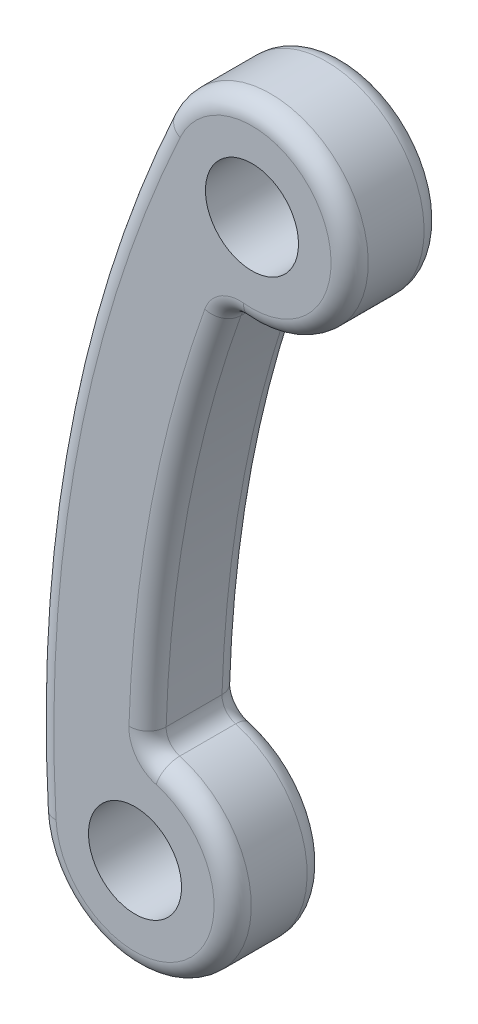
ISO-10303-21;
HEADER;
FILE_DESCRIPTION(('STEP AP214'),'2;1');
FILE_NAME('part.step','',(''),(''),'','','');
FILE_SCHEMA(('AUTOMOTIVE_DESIGN { 1 0 10303 214 1 1 1 1 }'));
ENDSEC;
DATA;
#1=APPLICATION_CONTEXT('core data for automotive mechanical design processes');
#2=APPLICATION_PROTOCOL_DEFINITION('international standard','automotive_design',2000,#1);
#3=PRODUCT_CONTEXT('',#1,'mechanical');
#4=PRODUCT('Part','Part','',(#3));
#5=PRODUCT_RELATED_PRODUCT_CATEGORY('part','',(#4));
#6=PRODUCT_DEFINITION_FORMATION('','',#4);
#7=PRODUCT_DEFINITION_CONTEXT('part definition',#1,'design');
#8=PRODUCT_DEFINITION('design','',#6,#7);
#9=PRODUCT_DEFINITION_SHAPE('','',#8);
#10=(LENGTH_UNIT() NAMED_UNIT(*) SI_UNIT(.MILLI.,.METRE.));
#11=(NAMED_UNIT(*) PLANE_ANGLE_UNIT() SI_UNIT($,.RADIAN.));
#12=(NAMED_UNIT(*) SI_UNIT($,.STERADIAN.) SOLID_ANGLE_UNIT());
#13=UNCERTAINTY_MEASURE_WITH_UNIT(LENGTH_MEASURE(1.E-05),#10,'distance_accuracy_value','');
#14=(GEOMETRIC_REPRESENTATION_CONTEXT(3) GLOBAL_UNCERTAINTY_ASSIGNED_CONTEXT((#13)) GLOBAL_UNIT_ASSIGNED_CONTEXT((#10,
#11,#12)) REPRESENTATION_CONTEXT('',''));
#15=CARTESIAN_POINT('',(0.,0.,0.));
#16=DIRECTION('',(0.,0.,1.));
#17=DIRECTION('',(1.,0.,0.));
#18=AXIS2_PLACEMENT_3D('',#15,#16,#17);
#19=CARTESIAN_POINT('',(-69.6406788681633,-3.90363251105414,10.));
#20=DIRECTION('',(0.,0.,1.));
#21=DIRECTION('',(1.,0.,0.));
#22=AXIS2_PLACEMENT_3D('',#19,#20,#21);
#23=PLANE('',#22);
#24=CARTESIAN_POINT('',(-128.014112855284,45.9171744543879,10.));
#25=DIRECTION('',(0.,0.,1.));
#26=DIRECTION('',(1.,0.,0.));
#27=AXIS2_PLACEMENT_3D('',#24,#25,#26);
#28=CIRCLE('',#27,4.);
#29=CARTESIAN_POINT('',(-127.597067497737,49.8953741941883,10.));
#30=VERTEX_POINT('',#29);
#31=CARTESIAN_POINT('',(-131.779233821616,47.2676795853993,10.));
#32=VERTEX_POINT('',#31);
#33=EDGE_CURVE('E121',#30,#32,#28,.T.);
#34=ORIENTED_EDGE('',*,*,#33,.F.);
#35=CARTESIAN_POINT('',(-126.710846112949,58.3490486412642,10.));
#36=DIRECTION('',(0.,0.,1.));
#37=DIRECTION('',(1.,0.,0.));
#38=AXIS2_PLACEMENT_3D('',#35,#36,#37);
#39=CIRCLE('',#38,8.49999999999992);
#40=CARTESIAN_POINT('',(-134.431578671802,61.9043670172552,10.));
#41=VERTEX_POINT('',#40);
#42=EDGE_CURVE('E125',#30,#41,#39,.T.);
#43=ORIENTED_EDGE('',*,*,#42,.T.);
#44=CARTESIAN_POINT('',(0.,0.,10.));
#45=DIRECTION('',(0.,0.,1.));
#46=DIRECTION('',(1.,0.,0.));
#47=AXIS2_PLACEMENT_3D('',#44,#45,#46);
#48=CIRCLE('',#47,148.);
#49=CARTESIAN_POINT('',(-147.768035447859,-8.28297651091058,10.));
#50=VERTEX_POINT('',#49);
#51=EDGE_CURVE('E148',#41,#50,#48,.T.);
#52=ORIENTED_EDGE('',*,*,#51,.T.);
#53=CARTESIAN_POINT('',(-139.281357736327,-7.80726502210829,10.));
#54=DIRECTION('',(0.,0.,1.));
#55=DIRECTION('',(1.,0.,0.));
#56=AXIS2_PLACEMENT_3D('',#53,#54,#55);
#57=CIRCLE('',#56,8.50000000000001);
#58=CARTESIAN_POINT('',(-137.005159936122,0.382296844948076,10.));
#59=VERTEX_POINT('',#58);
#60=EDGE_CURVE('E152',#50,#59,#57,.T.);
#61=ORIENTED_EDGE('',*,*,#60,.T.);
#62=CARTESIAN_POINT('',(-135.934008030143,4.23620831179809,10.));
#63=DIRECTION('',(0.,0.,1.));
#64=DIRECTION('',(1.,0.,0.));
#65=AXIS2_PLACEMENT_3D('',#62,#63,#64);
#66=CIRCLE('',#65,4.);
#67=CARTESIAN_POINT('',(-139.932067089853,4.3608026739098,10.));
#68=VERTEX_POINT('',#67);
#69=EDGE_CURVE('E251',#68,#59,#66,.T.);
#70=ORIENTED_EDGE('',*,*,#69,.F.);
#71=CARTESIAN_POINT('',(0.,0.,10.));
#72=DIRECTION('',(0.,0.,1.));
#73=DIRECTION('',(1.,0.,0.));
#74=AXIS2_PLACEMENT_3D('',#71,#72,#73);
#75=CIRCLE('',#74,140.);
#76=EDGE_CURVE('E127',#68,#32,#75,.F.);
#77=ORIENTED_EDGE('',*,*,#76,.T.);
#78=EDGE_LOOP('',(#34,#43,#52,#61,#70,#77));
#79=FACE_BOUND('',#78,.T.);
#80=CARTESIAN_POINT('',(-126.710846112949,58.3490486412642,10.));
#81=DIRECTION('',(0.,0.,1.));
#82=DIRECTION('',(1.,0.,0.));
#83=AXIS2_PLACEMENT_3D('',#80,#81,#82);
#84=CIRCLE('',#83,5.00000000000001);
#85=CARTESIAN_POINT('',(-121.710846112949,58.3490486412642,10.));
#86=VERTEX_POINT('',#85);
#87=EDGE_CURVE('E240',#86,#86,#84,.T.);
#88=ORIENTED_EDGE('',*,*,#87,.F.);
#89=EDGE_LOOP('',(#88));
#90=FACE_BOUND('',#89,.T.);
#91=CARTESIAN_POINT('',(-139.281357736327,-7.80726502210829,10.));
#92=DIRECTION('',(0.,0.,1.));
#93=DIRECTION('',(1.,0.,0.));
#94=AXIS2_PLACEMENT_3D('',#91,#92,#93);
#95=CIRCLE('',#94,4.99999999999999);
#96=CARTESIAN_POINT('',(-134.281357736327,-7.80726502210829,10.));
#97=VERTEX_POINT('',#96);
#98=EDGE_CURVE('E232',#97,#97,#95,.T.);
#99=ORIENTED_EDGE('',*,*,#98,.F.);
#100=EDGE_LOOP('',(#99));
#101=FACE_BOUND('',#100,.T.);
#102=ADVANCED_FACE('F33',(#79,#90,#101),#23,.T.);
#103=CARTESIAN_POINT('',(-69.6406788681633,-3.90363251105414,0.));
#104=DIRECTION('',(0.,0.,1.));
#105=DIRECTION('',(1.,0.,0.));
#106=AXIS2_PLACEMENT_3D('',#103,#104,#105);
#107=PLANE('',#106);
#108=CARTESIAN_POINT('',(0.,0.,0.));
#109=DIRECTION('',(0.,0.,1.));
#110=DIRECTION('',(1.,0.,0.));
#111=AXIS2_PLACEMENT_3D('',#108,#109,#110);
#112=CIRCLE('',#111,148.);
#113=CARTESIAN_POINT('',(-147.768035447859,-8.28297651091058,0.));
#114=VERTEX_POINT('',#113);
#115=CARTESIAN_POINT('',(-134.431578671802,61.9043670172552,0.));
#116=VERTEX_POINT('',#115);
#117=EDGE_CURVE('E171',#114,#116,#112,.F.);
#118=ORIENTED_EDGE('',*,*,#117,.T.);
#119=CARTESIAN_POINT('',(-126.710846112949,58.3490486412642,0.));
#120=DIRECTION('',(0.,0.,1.));
#121=DIRECTION('',(1.,0.,0.));
#122=AXIS2_PLACEMENT_3D('',#119,#120,#121);
#123=CIRCLE('',#122,8.49999999999992);
#124=CARTESIAN_POINT('',(-127.597067497737,49.8953741941883,0.));
#125=VERTEX_POINT('',#124);
#126=EDGE_CURVE('E175',#116,#125,#123,.F.);
#127=ORIENTED_EDGE('',*,*,#126,.T.);
#128=CARTESIAN_POINT('',(-128.014112855284,45.9171744543879,0.));
#129=DIRECTION('',(0.,0.,1.));
#130=DIRECTION('',(1.,0.,0.));
#131=AXIS2_PLACEMENT_3D('',#128,#129,#130);
#132=CIRCLE('',#131,4.);
#133=CARTESIAN_POINT('',(-131.779233821616,47.2676795853993,0.));
#134=VERTEX_POINT('',#133);
#135=EDGE_CURVE('E173',#134,#125,#132,.F.);
#136=ORIENTED_EDGE('',*,*,#135,.F.);
#137=CARTESIAN_POINT('',(0.,0.,0.));
#138=DIRECTION('',(0.,0.,1.));
#139=DIRECTION('',(1.,0.,0.));
#140=AXIS2_PLACEMENT_3D('',#137,#138,#139);
#141=CIRCLE('',#140,140.);
#142=CARTESIAN_POINT('',(-139.932067089853,4.3608026739098,0.));
#143=VERTEX_POINT('',#142);
#144=EDGE_CURVE('E167',#134,#143,#141,.T.);
#145=ORIENTED_EDGE('',*,*,#144,.T.);
#146=CARTESIAN_POINT('',(-135.934008030143,4.23620831179809,0.));
#147=DIRECTION('',(0.,0.,1.));
#148=DIRECTION('',(1.,0.,0.));
#149=AXIS2_PLACEMENT_3D('',#146,#147,#148);
#150=CIRCLE('',#149,4.);
#151=CARTESIAN_POINT('',(-137.005159936122,0.382296844948076,0.));
#152=VERTEX_POINT('',#151);
#153=EDGE_CURVE('E164',#152,#143,#150,.F.);
#154=ORIENTED_EDGE('',*,*,#153,.F.);
#155=CARTESIAN_POINT('',(-139.281357736327,-7.80726502210829,0.));
#156=DIRECTION('',(0.,0.,1.));
#157=DIRECTION('',(1.,0.,0.));
#158=AXIS2_PLACEMENT_3D('',#155,#156,#157);
#159=CIRCLE('',#158,8.50000000000001);
#160=EDGE_CURVE('E169',#152,#114,#159,.F.);
#161=ORIENTED_EDGE('',*,*,#160,.T.);
#162=EDGE_LOOP('',(#118,#127,#136,#145,#154,#161));
#163=FACE_BOUND('',#162,.T.);
#164=CARTESIAN_POINT('',(-126.710846112949,58.3490486412642,0.));
#165=DIRECTION('',(0.,0.,1.));
#166=DIRECTION('',(1.,0.,0.));
#167=AXIS2_PLACEMENT_3D('',#164,#165,#166);
#168=CIRCLE('',#167,5.00000000000001);
#169=CARTESIAN_POINT('',(-121.710846112949,58.3490486412642,0.));
#170=VERTEX_POINT('',#169);
#171=EDGE_CURVE('E237',#170,#170,#168,.T.);
#172=ORIENTED_EDGE('',*,*,#171,.T.);
#173=EDGE_LOOP('',(#172));
#174=FACE_BOUND('',#173,.T.);
#175=CARTESIAN_POINT('',(-139.281357736327,-7.80726502210829,0.));
#176=DIRECTION('',(0.,0.,1.));
#177=DIRECTION('',(1.,0.,0.));
#178=AXIS2_PLACEMENT_3D('',#175,#176,#177);
#179=CIRCLE('',#178,4.99999999999999);
#180=CARTESIAN_POINT('',(-134.281357736327,-7.80726502210829,0.));
#181=VERTEX_POINT('',#180);
#182=EDGE_CURVE('E226',#181,#181,#179,.T.);
#183=ORIENTED_EDGE('',*,*,#182,.T.);
#184=EDGE_LOOP('',(#183));
#185=FACE_BOUND('',#184,.T.);
#186=ADVANCED_FACE('F280',(#163,#174,#185),#107,.F.);
#187=CARTESIAN_POINT('',(0.,0.,10.));
#188=DIRECTION('',(0.,0.,-1.));
#189=DIRECTION('',(-1.,0.,0.));
#190=AXIS2_PLACEMENT_3D('',#187,#188,#189);
#191=CYLINDRICAL_SURFACE('',#190,138.);
#192=CARTESIAN_POINT('',(0.,0.,8.));
#193=DIRECTION('',(0.,0.,1.));
#194=DIRECTION('',(1.,0.,0.));
#195=AXIS2_PLACEMENT_3D('',#192,#193,#194);
#196=CIRCLE('',#195,138.);
#197=CARTESIAN_POINT('',(-129.89667333845,46.5924270198936,8.));
#198=VERTEX_POINT('',#197);
#199=CARTESIAN_POINT('',(-137.933037559998,4.29850549285394,8.));
#200=VERTEX_POINT('',#199);
#201=EDGE_CURVE('E42',#198,#200,#196,.T.);
#202=ORIENTED_EDGE('',*,*,#201,.T.);
#203=DIRECTION('',(0.,0.,-1.));
#204=VECTOR('',#203,1.);
#205=CARTESIAN_POINT('',(-137.933037559998,4.29850549285394,10.));
#206=LINE('',#205,#204);
#207=CARTESIAN_POINT('',(-137.933037559998,4.29850549285394,2.));
#208=VERTEX_POINT('',#207);
#209=EDGE_CURVE('E11',#200,#208,#206,.T.);
#210=ORIENTED_EDGE('',*,*,#209,.T.);
#211=CARTESIAN_POINT('',(0.,0.,2.));
#212=DIRECTION('',(0.,0.,1.));
#213=DIRECTION('',(1.,0.,0.));
#214=AXIS2_PLACEMENT_3D('',#211,#212,#213);
#215=CIRCLE('',#214,138.);
#216=CARTESIAN_POINT('',(-129.89667333845,46.5924270198936,2.));
#217=VERTEX_POINT('',#216);
#218=EDGE_CURVE('E184',#208,#217,#215,.F.);
#219=ORIENTED_EDGE('',*,*,#218,.T.);
#220=DIRECTION('',(0.,0.,-1.));
#221=VECTOR('',#220,1.);
#222=CARTESIAN_POINT('',(-129.89667333845,46.5924270198936,10.));
#223=LINE('',#222,#221);
#224=EDGE_CURVE('E53',#217,#198,#223,.F.);
#225=ORIENTED_EDGE('',*,*,#224,.T.);
#226=EDGE_LOOP('',(#202,#210,#219,#225));
#227=FACE_BOUND('',#226,.T.);
#228=ADVANCED_FACE('F311',(#227),#191,.F.);
#229=CARTESIAN_POINT('',(-126.710846112949,58.3490486412642,10.));
#230=DIRECTION('',(0.,0.,-1.));
#231=DIRECTION('',(-1.,0.,0.));
#232=AXIS2_PLACEMENT_3D('',#229,#230,#231);
#233=CYLINDRICAL_SURFACE('',#232,10.4999999999999);
#234=DIRECTION('',(0.,0.,-1.));
#235=VECTOR('',#234,1.);
#236=CARTESIAN_POINT('',(-136.248221626827,62.7409125174884,10.));
#237=LINE('',#236,#235);
#238=CARTESIAN_POINT('',(-136.248221626827,62.7409125174884,8.));
#239=VERTEX_POINT('',#238);
#240=CARTESIAN_POINT('',(-136.248221626827,62.7409125174884,2.));
#241=VERTEX_POINT('',#240);
#242=EDGE_CURVE('E131',#239,#241,#237,.T.);
#243=ORIENTED_EDGE('',*,*,#242,.F.);
#244=CARTESIAN_POINT('',(-126.710846112949,58.3490486412642,8.));
#245=DIRECTION('',(0.,0.,1.));
#246=DIRECTION('',(1.,0.,0.));
#247=AXIS2_PLACEMENT_3D('',#244,#245,#246);
#248=CIRCLE('',#247,10.4999999999999);
#249=CARTESIAN_POINT('',(-127.80559017651,47.9062743242881,8.));
#250=VERTEX_POINT('',#249);
#251=EDGE_CURVE('E157',#239,#250,#248,.F.);
#252=ORIENTED_EDGE('',*,*,#251,.T.);
#253=DIRECTION('',(0.,0.,-1.));
#254=VECTOR('',#253,1.);
#255=CARTESIAN_POINT('',(-127.80559017651,47.9062743242881,10.));
#256=LINE('',#255,#254);
#257=CARTESIAN_POINT('',(-127.80559017651,47.9062743242881,2.));
#258=VERTEX_POINT('',#257);
#259=EDGE_CURVE('E147',#250,#258,#256,.T.);
#260=ORIENTED_EDGE('',*,*,#259,.T.);
#261=CARTESIAN_POINT('',(-126.710846112949,58.3490486412642,2.));
#262=DIRECTION('',(0.,0.,1.));
#263=DIRECTION('',(1.,0.,0.));
#264=AXIS2_PLACEMENT_3D('',#261,#262,#263);
#265=CIRCLE('',#264,10.4999999999999);
#266=EDGE_CURVE('E150',#258,#241,#265,.T.);
#267=ORIENTED_EDGE('',*,*,#266,.T.);
#268=EDGE_LOOP('',(#243,#252,#260,#267));
#269=FACE_BOUND('',#268,.T.);
#270=ADVANCED_FACE('F295',(#269),#233,.T.);
#271=CARTESIAN_POINT('',(0.,0.,10.));
#272=DIRECTION('',(0.,0.,-1.));
#273=DIRECTION('',(-1.,0.,0.));
#274=AXIS2_PLACEMENT_3D('',#271,#272,#273);
#275=CYLINDRICAL_SURFACE('',#274,150.);
#276=DIRECTION('',(0.,0.,-1.));
#277=VECTOR('',#276,1.);
#278=CARTESIAN_POINT('',(-149.764900791749,-8.39490862592289,10.));
#279=LINE('',#278,#277);
#280=CARTESIAN_POINT('',(-149.764900791749,-8.39490862592289,8.));
#281=VERTEX_POINT('',#280);
#282=CARTESIAN_POINT('',(-149.764900791749,-8.39490862592289,2.));
#283=VERTEX_POINT('',#282);
#284=EDGE_CURVE('E243',#281,#283,#279,.T.);
#285=ORIENTED_EDGE('',*,*,#284,.F.);
#286=CARTESIAN_POINT('',(0.,0.,8.));
#287=DIRECTION('',(0.,0.,1.));
#288=DIRECTION('',(1.,0.,0.));
#289=AXIS2_PLACEMENT_3D('',#286,#287,#288);
#290=CIRCLE('',#289,150.);
#291=EDGE_CURVE('E162',#281,#239,#290,.F.);
#292=ORIENTED_EDGE('',*,*,#291,.T.);
#293=ORIENTED_EDGE('',*,*,#242,.T.);
#294=CARTESIAN_POINT('',(0.,0.,2.));
#295=DIRECTION('',(0.,0.,1.));
#296=DIRECTION('',(1.,0.,0.));
#297=AXIS2_PLACEMENT_3D('',#294,#295,#296);
#298=CIRCLE('',#297,150.);
#299=EDGE_CURVE('E160',#241,#283,#298,.T.);
#300=ORIENTED_EDGE('',*,*,#299,.T.);
#301=EDGE_LOOP('',(#285,#292,#293,#300));
#302=FACE_BOUND('',#301,.T.);
#303=ADVANCED_FACE('F270',(#302),#275,.T.);
#304=CARTESIAN_POINT('',(-139.281357736327,-7.80726502210829,10.));
#305=DIRECTION('',(0.,0.,-1.));
#306=DIRECTION('',(-1.,0.,0.));
#307=AXIS2_PLACEMENT_3D('',#304,#305,#306);
#308=CYLINDRICAL_SURFACE('',#307,10.5);
#309=DIRECTION('',(0.,0.,-1.));
#310=VECTOR('',#309,1.);
#311=CARTESIAN_POINT('',(-136.469583983133,2.3092525783731,10.));
#312=LINE('',#311,#310);
#313=CARTESIAN_POINT('',(-136.469583983133,2.3092525783731,2.));
#314=VERTEX_POINT('',#313);
#315=CARTESIAN_POINT('',(-136.469583983133,2.3092525783731,8.));
#316=VERTEX_POINT('',#315);
#317=EDGE_CURVE('E178',#314,#316,#312,.F.);
#318=ORIENTED_EDGE('',*,*,#317,.T.);
#319=CARTESIAN_POINT('',(-139.281357736327,-7.80726502210829,8.));
#320=DIRECTION('',(0.,0.,1.));
#321=DIRECTION('',(1.,0.,0.));
#322=AXIS2_PLACEMENT_3D('',#319,#320,#321);
#323=CIRCLE('',#322,10.5);
#324=EDGE_CURVE('E182',#316,#281,#323,.F.);
#325=ORIENTED_EDGE('',*,*,#324,.T.);
#326=ORIENTED_EDGE('',*,*,#284,.T.);
#327=CARTESIAN_POINT('',(-139.281357736327,-7.80726502210829,2.));
#328=DIRECTION('',(0.,0.,1.));
#329=DIRECTION('',(1.,0.,0.));
#330=AXIS2_PLACEMENT_3D('',#327,#328,#329);
#331=CIRCLE('',#330,10.5);
#332=EDGE_CURVE('E180',#283,#314,#331,.T.);
#333=ORIENTED_EDGE('',*,*,#332,.T.);
#334=EDGE_LOOP('',(#318,#325,#326,#333));
#335=FACE_BOUND('',#334,.T.);
#336=ADVANCED_FACE('F265',(#335),#308,.T.);
#337=CARTESIAN_POINT('',(-126.710846112949,58.3490486412642,10.));
#338=DIRECTION('',(0.,0.,-1.));
#339=DIRECTION('',(-1.,0.,0.));
#340=AXIS2_PLACEMENT_3D('',#337,#338,#339);
#341=CYLINDRICAL_SURFACE('',#340,5.00000000000001);
#342=ORIENTED_EDGE('',*,*,#87,.T.);
#343=EDGE_LOOP('',(#342));
#344=FACE_BOUND('',#343,.T.);
#345=ORIENTED_EDGE('',*,*,#171,.F.);
#346=EDGE_LOOP('',(#345));
#347=FACE_BOUND('',#346,.T.);
#348=ADVANCED_FACE('F314',(#344,#347),#341,.F.);
#349=CARTESIAN_POINT('',(-139.281357736327,-7.80726502210829,10.));
#350=DIRECTION('',(0.,0.,-1.));
#351=DIRECTION('',(-1.,0.,0.));
#352=AXIS2_PLACEMENT_3D('',#349,#350,#351);
#353=CYLINDRICAL_SURFACE('',#352,4.99999999999999);
#354=ORIENTED_EDGE('',*,*,#98,.T.);
#355=EDGE_LOOP('',(#354));
#356=FACE_BOUND('',#355,.T.);
#357=ORIENTED_EDGE('',*,*,#182,.F.);
#358=EDGE_LOOP('',(#357));
#359=FACE_BOUND('',#358,.T.);
#360=ADVANCED_FACE('F347',(#356,#359),#353,.F.);
#361=CARTESIAN_POINT('',(-139.281357736327,-7.80726502210829,2.));
#362=DIRECTION('',(0.,0.,1.));
#363=DIRECTION('',(1.,0.,0.));
#364=AXIS2_PLACEMENT_3D('',#361,#362,#363);
#365=TOROIDAL_SURFACE('',#364,8.50000000000001,2.);
#366=CARTESIAN_POINT('',(-137.005159936122,0.382296844948075,2.));
#367=DIRECTION('',(-0.963477866712511,0.267787976494668,0.));
#368=DIRECTION('',(-0.267787976494668,-0.963477866712511,0.));
#369=AXIS2_PLACEMENT_3D('',#366,#367,#368);
#370=CIRCLE('',#369,2.);
#371=EDGE_CURVE('E220',#314,#152,#370,.T.);
#372=ORIENTED_EDGE('',*,*,#371,.F.);
#373=ORIENTED_EDGE('',*,*,#332,.F.);
#374=CARTESIAN_POINT('',(-147.768035447859,-8.28297651091058,2.));
#375=DIRECTION('',(-0.0559660575061528,0.998432671944993,0.));
#376=DIRECTION('',(-0.998432671944993,-0.0559660575061528,0.));
#377=AXIS2_PLACEMENT_3D('',#374,#375,#376);
#378=CIRCLE('',#377,2.);
#379=EDGE_CURVE('E37',#114,#283,#378,.T.);
#380=ORIENTED_EDGE('',*,*,#379,.F.);
#381=ORIENTED_EDGE('',*,*,#160,.F.);
#382=EDGE_LOOP('',(#372,#373,#380,#381));
#383=FACE_BOUND('',#382,.T.);
#384=ADVANCED_FACE('F35',(#383),#365,.T.);
#385=CARTESIAN_POINT('',(0.,0.,2.));
#386=DIRECTION('',(0.,0.,1.));
#387=DIRECTION('',(1.,0.,0.));
#388=AXIS2_PLACEMENT_3D('',#385,#386,#387);
#389=TOROIDAL_SURFACE('',#388,148.,2.);
#390=ORIENTED_EDGE('',*,*,#379,.T.);
#391=ORIENTED_EDGE('',*,*,#299,.F.);
#392=CARTESIAN_POINT('',(-134.431578671802,61.9043670172552,2.));
#393=DIRECTION('',(0.418272750116593,0.908321477512176,0.));
#394=DIRECTION('',(-0.908321477512176,0.418272750116593,0.));
#395=AXIS2_PLACEMENT_3D('',#392,#393,#394);
#396=CIRCLE('',#395,2.);
#397=EDGE_CURVE('E218',#116,#241,#396,.T.);
#398=ORIENTED_EDGE('',*,*,#397,.F.);
#399=ORIENTED_EDGE('',*,*,#117,.F.);
#400=EDGE_LOOP('',(#390,#391,#398,#399));
#401=FACE_BOUND('',#400,.T.);
#402=ADVANCED_FACE('F273',(#401),#389,.T.);
#403=CARTESIAN_POINT('',(-135.934008030143,4.23620831179809,2.));
#404=DIRECTION('',(0.,0.,1.));
#405=DIRECTION('',(1.,0.,0.));
#406=AXIS2_PLACEMENT_3D('',#403,#404,#405);
#407=TOROIDAL_SURFACE('',#406,4.,2.);
#408=ORIENTED_EDGE('',*,*,#371,.T.);
#409=ORIENTED_EDGE('',*,*,#153,.T.);
#410=CARTESIAN_POINT('',(-139.932067089853,4.3608026739098,2.));
#411=DIRECTION('',(-0.0311485905279271,-0.999514764927524,0.));
#412=DIRECTION('',(0.999514764927524,-0.0311485905279271,0.));
#413=AXIS2_PLACEMENT_3D('',#410,#411,#412);
#414=CIRCLE('',#413,2.);
#415=EDGE_CURVE('E215',#208,#143,#414,.F.);
#416=ORIENTED_EDGE('',*,*,#415,.F.);
#417=CARTESIAN_POINT('',(-135.934008030143,4.23620831179809,2.));
#418=DIRECTION('',(0.,0.,1.));
#419=DIRECTION('',(1.,0.,0.));
#420=AXIS2_PLACEMENT_3D('',#417,#418,#419);
#421=CIRCLE('',#420,2.);
#422=EDGE_CURVE('E212',#314,#208,#421,.F.);
#423=ORIENTED_EDGE('',*,*,#422,.F.);
#424=EDGE_LOOP('',(#408,#409,#416,#423));
#425=FACE_BOUND('',#424,.T.);
#426=ADVANCED_FACE('F286',(#425),#407,.T.);
#427=CARTESIAN_POINT('',(-126.710846112949,58.3490486412642,2.));
#428=DIRECTION('',(0.,0.,1.));
#429=DIRECTION('',(1.,0.,0.));
#430=AXIS2_PLACEMENT_3D('',#427,#428,#429);
#431=TOROIDAL_SURFACE('',#430,8.49999999999992,2.);
#432=ORIENTED_EDGE('',*,*,#397,.T.);
#433=ORIENTED_EDGE('',*,*,#266,.F.);
#434=CARTESIAN_POINT('',(-127.597067497737,49.8953741941883,2.));
#435=DIRECTION('',(-0.994549934950112,0.104261339386791,0.));
#436=DIRECTION('',(-0.104261339386791,-0.994549934950112,0.));
#437=AXIS2_PLACEMENT_3D('',#434,#435,#436);
#438=CIRCLE('',#437,2.);
#439=EDGE_CURVE('E209',#125,#258,#438,.T.);
#440=ORIENTED_EDGE('',*,*,#439,.F.);
#441=ORIENTED_EDGE('',*,*,#126,.F.);
#442=EDGE_LOOP('',(#432,#433,#440,#441));
#443=FACE_BOUND('',#442,.T.);
#444=ADVANCED_FACE('F277',(#443),#431,.T.);
#445=CARTESIAN_POINT('',(0.,0.,2.));
#446=DIRECTION('',(0.,0.,1.));
#447=DIRECTION('',(1.,0.,0.));
#448=AXIS2_PLACEMENT_3D('',#445,#446,#447);
#449=TOROIDAL_SURFACE('',#448,140.,2.);
#450=ORIENTED_EDGE('',*,*,#415,.T.);
#451=ORIENTED_EDGE('',*,*,#144,.F.);
#452=CARTESIAN_POINT('',(-131.779233821616,47.2676795853993,2.));
#453=DIRECTION('',(0.337626282752854,0.941280241582968,0.));
#454=DIRECTION('',(-0.941280241582968,0.337626282752854,0.));
#455=AXIS2_PLACEMENT_3D('',#452,#453,#454);
#456=CIRCLE('',#455,2.);
#457=EDGE_CURVE('E206',#217,#134,#456,.T.);
#458=ORIENTED_EDGE('',*,*,#457,.F.);
#459=ORIENTED_EDGE('',*,*,#218,.F.);
#460=EDGE_LOOP('',(#450,#451,#458,#459));
#461=FACE_BOUND('',#460,.T.);
#462=ADVANCED_FACE('F375',(#461),#449,.T.);
#463=CARTESIAN_POINT('',(-135.934008030143,4.23620831179809,10.));
#464=DIRECTION('',(0.,0.,-1.));
#465=DIRECTION('',(-1.,0.,0.));
#466=AXIS2_PLACEMENT_3D('',#463,#464,#465);
#467=CYLINDRICAL_SURFACE('',#466,2.);
#468=ORIENTED_EDGE('',*,*,#422,.T.);
#469=ORIENTED_EDGE('',*,*,#209,.F.);
#470=CARTESIAN_POINT('',(-135.934008030143,4.23620831179809,8.));
#471=DIRECTION('',(0.,0.,1.));
#472=DIRECTION('',(1.,0.,0.));
#473=AXIS2_PLACEMENT_3D('',#470,#471,#472);
#474=CIRCLE('',#473,2.);
#475=EDGE_CURVE('E203',#316,#200,#474,.F.);
#476=ORIENTED_EDGE('',*,*,#475,.F.);
#477=ORIENTED_EDGE('',*,*,#317,.F.);
#478=EDGE_LOOP('',(#468,#469,#476,#477));
#479=FACE_BOUND('',#478,.T.);
#480=ADVANCED_FACE('F288',(#479),#467,.F.);
#481=CARTESIAN_POINT('',(-128.014112855284,45.9171744543879,2.));
#482=DIRECTION('',(0.,0.,1.));
#483=DIRECTION('',(1.,0.,0.));
#484=AXIS2_PLACEMENT_3D('',#481,#482,#483);
#485=TOROIDAL_SURFACE('',#484,4.,2.);
#486=ORIENTED_EDGE('',*,*,#135,.T.);
#487=ORIENTED_EDGE('',*,*,#439,.T.);
#488=CARTESIAN_POINT('',(-128.014112855284,45.9171744543879,2.));
#489=DIRECTION('',(0.,0.,1.));
#490=DIRECTION('',(1.,0.,0.));
#491=AXIS2_PLACEMENT_3D('',#488,#489,#490);
#492=CIRCLE('',#491,2.);
#493=EDGE_CURVE('E200',#217,#258,#492,.F.);
#494=ORIENTED_EDGE('',*,*,#493,.F.);
#495=ORIENTED_EDGE('',*,*,#457,.T.);
#496=EDGE_LOOP('',(#486,#487,#494,#495));
#497=FACE_BOUND('',#496,.T.);
#498=ADVANCED_FACE('F389',(#497),#485,.T.);
#499=CARTESIAN_POINT('',(-135.934008030143,4.23620831179809,8.));
#500=DIRECTION('',(0.,0.,1.));
#501=DIRECTION('',(1.,0.,0.));
#502=AXIS2_PLACEMENT_3D('',#499,#500,#501);
#503=TOROIDAL_SURFACE('',#502,4.,2.);
#504=CARTESIAN_POINT('',(-137.005159936122,0.382296844948076,8.));
#505=DIRECTION('',(-0.963477866712511,0.267787976494668,0.));
#506=DIRECTION('',(-0.267787976494668,-0.963477866712511,0.));
#507=AXIS2_PLACEMENT_3D('',#504,#505,#506);
#508=CIRCLE('',#507,2.);
#509=EDGE_CURVE('E194',#316,#59,#508,.F.);
#510=ORIENTED_EDGE('',*,*,#509,.F.);
#511=ORIENTED_EDGE('',*,*,#475,.T.);
#512=CARTESIAN_POINT('',(-139.932067089853,4.3608026739098,8.));
#513=DIRECTION('',(-0.0311485905279271,-0.999514764927524,0.));
#514=DIRECTION('',(0.999514764927524,-0.0311485905279271,0.));
#515=AXIS2_PLACEMENT_3D('',#512,#513,#514);
#516=CIRCLE('',#515,2.);
#517=EDGE_CURVE('E197',#68,#200,#516,.F.);
#518=ORIENTED_EDGE('',*,*,#517,.F.);
#519=ORIENTED_EDGE('',*,*,#69,.T.);
#520=EDGE_LOOP('',(#510,#511,#518,#519));
#521=FACE_BOUND('',#520,.T.);
#522=ADVANCED_FACE('F259',(#521),#503,.T.);
#523=CARTESIAN_POINT('',(-128.014112855284,45.9171744543879,10.));
#524=DIRECTION('',(0.,0.,-1.));
#525=DIRECTION('',(-1.,0.,0.));
#526=AXIS2_PLACEMENT_3D('',#523,#524,#525);
#527=CYLINDRICAL_SURFACE('',#526,2.);
#528=ORIENTED_EDGE('',*,*,#493,.T.);
#529=ORIENTED_EDGE('',*,*,#259,.F.);
#530=CARTESIAN_POINT('',(-128.014112855284,45.9171744543879,8.));
#531=DIRECTION('',(0.,0.,1.));
#532=DIRECTION('',(1.,0.,0.));
#533=AXIS2_PLACEMENT_3D('',#530,#531,#532);
#534=CIRCLE('',#533,2.);
#535=EDGE_CURVE('E137',#198,#250,#534,.F.);
#536=ORIENTED_EDGE('',*,*,#535,.F.);
#537=ORIENTED_EDGE('',*,*,#224,.F.);
#538=EDGE_LOOP('',(#528,#529,#536,#537));
#539=FACE_BOUND('',#538,.T.);
#540=ADVANCED_FACE('F292',(#539),#527,.F.);
#541=CARTESIAN_POINT('',(0.,0.,8.));
#542=DIRECTION('',(0.,0.,1.));
#543=DIRECTION('',(1.,0.,0.));
#544=AXIS2_PLACEMENT_3D('',#541,#542,#543);
#545=TOROIDAL_SURFACE('',#544,140.,2.);
#546=ORIENTED_EDGE('',*,*,#517,.T.);
#547=ORIENTED_EDGE('',*,*,#201,.F.);
#548=CARTESIAN_POINT('',(-131.779233821616,47.2676795853993,8.));
#549=DIRECTION('',(0.337626282752854,0.941280241582968,0.));
#550=DIRECTION('',(-0.941280241582968,0.337626282752854,0.));
#551=AXIS2_PLACEMENT_3D('',#548,#549,#550);
#552=CIRCLE('',#551,2.);
#553=EDGE_CURVE('E191',#32,#198,#552,.T.);
#554=ORIENTED_EDGE('',*,*,#553,.F.);
#555=ORIENTED_EDGE('',*,*,#76,.F.);
#556=EDGE_LOOP('',(#546,#547,#554,#555));
#557=FACE_BOUND('',#556,.T.);
#558=ADVANCED_FACE('F290',(#557),#545,.T.);
#559=CARTESIAN_POINT('',(-139.281357736327,-7.80726502210829,8.));
#560=DIRECTION('',(0.,0.,1.));
#561=DIRECTION('',(1.,0.,0.));
#562=AXIS2_PLACEMENT_3D('',#559,#560,#561);
#563=TOROIDAL_SURFACE('',#562,8.50000000000001,2.);
#564=ORIENTED_EDGE('',*,*,#509,.T.);
#565=ORIENTED_EDGE('',*,*,#60,.F.);
#566=CARTESIAN_POINT('',(-147.768035447859,-8.28297651091058,8.));
#567=DIRECTION('',(-0.0559660575061519,0.998432671944993,0.));
#568=DIRECTION('',(-0.998432671944993,-0.0559660575061519,0.));
#569=AXIS2_PLACEMENT_3D('',#566,#567,#568);
#570=CIRCLE('',#569,2.);
#571=EDGE_CURVE('E141',#281,#50,#570,.T.);
#572=ORIENTED_EDGE('',*,*,#571,.F.);
#573=ORIENTED_EDGE('',*,*,#324,.F.);
#574=EDGE_LOOP('',(#564,#565,#572,#573));
#575=FACE_BOUND('',#574,.T.);
#576=ADVANCED_FACE('F261',(#575),#563,.T.);
#577=CARTESIAN_POINT('',(-128.014112855284,45.9171744543879,8.));
#578=DIRECTION('',(0.,0.,1.));
#579=DIRECTION('',(1.,0.,0.));
#580=AXIS2_PLACEMENT_3D('',#577,#578,#579);
#581=TOROIDAL_SURFACE('',#580,4.,2.);
#582=ORIENTED_EDGE('',*,*,#553,.T.);
#583=ORIENTED_EDGE('',*,*,#535,.T.);
#584=CARTESIAN_POINT('',(-127.597067497737,49.8953741941883,8.));
#585=DIRECTION('',(-0.994549934950112,0.104261339386791,0.));
#586=DIRECTION('',(-0.104261339386791,-0.994549934950112,0.));
#587=AXIS2_PLACEMENT_3D('',#584,#585,#586);
#588=CIRCLE('',#587,2.);
#589=EDGE_CURVE('E134',#30,#250,#588,.F.);
#590=ORIENTED_EDGE('',*,*,#589,.F.);
#591=ORIENTED_EDGE('',*,*,#33,.T.);
#592=EDGE_LOOP('',(#582,#583,#590,#591));
#593=FACE_BOUND('',#592,.T.);
#594=ADVANCED_FACE('F135',(#593),#581,.T.);
#595=CARTESIAN_POINT('',(0.,0.,8.));
#596=DIRECTION('',(0.,0.,1.));
#597=DIRECTION('',(1.,0.,0.));
#598=AXIS2_PLACEMENT_3D('',#595,#596,#597);
#599=TOROIDAL_SURFACE('',#598,148.,2.);
#600=ORIENTED_EDGE('',*,*,#571,.T.);
#601=ORIENTED_EDGE('',*,*,#51,.F.);
#602=CARTESIAN_POINT('',(-134.431578671802,61.9043670172552,8.));
#603=DIRECTION('',(0.41827275011659,0.908321477512177,0.));
#604=DIRECTION('',(-0.908321477512177,0.41827275011659,0.));
#605=AXIS2_PLACEMENT_3D('',#602,#603,#604);
#606=CIRCLE('',#605,2.);
#607=EDGE_CURVE('E142',#239,#41,#606,.T.);
#608=ORIENTED_EDGE('',*,*,#607,.F.);
#609=ORIENTED_EDGE('',*,*,#291,.F.);
#610=EDGE_LOOP('',(#600,#601,#608,#609));
#611=FACE_BOUND('',#610,.T.);
#612=ADVANCED_FACE('F297',(#611),#599,.T.);
#613=CARTESIAN_POINT('',(-126.710846112949,58.3490486412642,8.));
#614=DIRECTION('',(0.,0.,1.));
#615=DIRECTION('',(1.,0.,0.));
#616=AXIS2_PLACEMENT_3D('',#613,#614,#615);
#617=TOROIDAL_SURFACE('',#616,8.49999999999992,2.);
#618=ORIENTED_EDGE('',*,*,#589,.T.);
#619=ORIENTED_EDGE('',*,*,#251,.F.);
#620=ORIENTED_EDGE('',*,*,#607,.T.);
#621=ORIENTED_EDGE('',*,*,#42,.F.);
#622=EDGE_LOOP('',(#618,#619,#620,#621));
#623=FACE_BOUND('',#622,.T.);
#624=ADVANCED_FACE('F144',(#623),#617,.T.);
#625=CLOSED_SHELL('',(#102,#186,#228,#270,#303,#336,#348,#360,#384,#402,#426,#444,#462,#480,
#498,#522,#540,#558,#576,#594,#612,#624));
#626=MANIFOLD_SOLID_BREP('B2',#625);
#627=ADVANCED_BREP_SHAPE_REPRESENTATION('',(#18,#626),#14);
#628=SHAPE_DEFINITION_REPRESENTATION(#9,#627);
ENDSEC;
END-ISO-10303-21;
